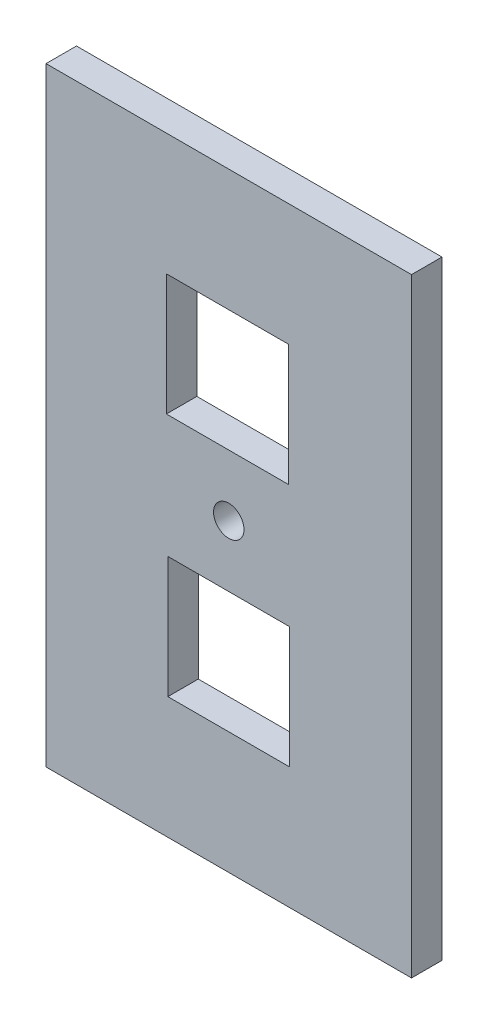
ISO-10303-21;
HEADER;
FILE_DESCRIPTION(('STEP AP214'),'2;1');
FILE_NAME('part.step','',(''),(''),'','','');
FILE_SCHEMA(('AUTOMOTIVE_DESIGN { 1 0 10303 214 1 1 1 1 }'));
ENDSEC;
DATA;
#1=APPLICATION_CONTEXT('core data for automotive mechanical design processes');
#2=APPLICATION_PROTOCOL_DEFINITION('international standard','automotive_design',2000,#1);
#3=PRODUCT_CONTEXT('',#1,'mechanical');
#4=PRODUCT('Part','Part','',(#3));
#5=PRODUCT_RELATED_PRODUCT_CATEGORY('part','',(#4));
#6=PRODUCT_DEFINITION_FORMATION('','',#4);
#7=PRODUCT_DEFINITION_CONTEXT('part definition',#1,'design');
#8=PRODUCT_DEFINITION('design','',#6,#7);
#9=PRODUCT_DEFINITION_SHAPE('','',#8);
#10=(LENGTH_UNIT() NAMED_UNIT(*) SI_UNIT(.MILLI.,.METRE.));
#11=(NAMED_UNIT(*) PLANE_ANGLE_UNIT() SI_UNIT($,.RADIAN.));
#12=(NAMED_UNIT(*) SI_UNIT($,.STERADIAN.) SOLID_ANGLE_UNIT());
#13=UNCERTAINTY_MEASURE_WITH_UNIT(LENGTH_MEASURE(1.E-05),#10,'distance_accuracy_value','');
#14=(GEOMETRIC_REPRESENTATION_CONTEXT(3) GLOBAL_UNCERTAINTY_ASSIGNED_CONTEXT((#13)) GLOBAL_UNIT_ASSIGNED_CONTEXT((#10,
#11,#12)) REPRESENTATION_CONTEXT('',''));
#15=CARTESIAN_POINT('',(0.,0.,0.));
#16=DIRECTION('',(0.,0.,1.));
#17=DIRECTION('',(1.,0.,0.));
#18=AXIS2_PLACEMENT_3D('',#15,#16,#17);
#19=CARTESIAN_POINT('',(0.,0.,6.35));
#20=DIRECTION('',(0.,1.,0.));
#21=DIRECTION('',(0.,0.,1.));
#22=AXIS2_PLACEMENT_3D('',#19,#20,#21);
#23=PLANE('',#22);
#24=DIRECTION('',(1.,0.,0.));
#25=VECTOR('',#24,1.);
#26=CARTESIAN_POINT('',(0.,0.,0.));
#27=LINE('',#26,#25);
#28=CARTESIAN_POINT('',(0.,0.,0.));
#29=VERTEX_POINT('',#28);
#30=CARTESIAN_POINT('',(76.2,0.,0.));
#31=VERTEX_POINT('',#30);
#32=EDGE_CURVE('E187',#29,#31,#27,.T.);
#33=ORIENTED_EDGE('',*,*,#32,.T.);
#34=DIRECTION('',(0.,0.,-1.));
#35=VECTOR('',#34,1.);
#36=CARTESIAN_POINT('',(76.2,0.,6.35));
#37=LINE('',#36,#35);
#38=CARTESIAN_POINT('',(76.2,0.,6.35));
#39=VERTEX_POINT('',#38);
#40=EDGE_CURVE('E11',#39,#31,#37,.T.);
#41=ORIENTED_EDGE('',*,*,#40,.F.);
#42=DIRECTION('',(1.,0.,0.));
#43=VECTOR('',#42,1.);
#44=CARTESIAN_POINT('',(0.,0.,6.35));
#45=LINE('',#44,#43);
#46=CARTESIAN_POINT('',(0.,0.,6.35));
#47=VERTEX_POINT('',#46);
#48=EDGE_CURVE('E194',#47,#39,#45,.T.);
#49=ORIENTED_EDGE('',*,*,#48,.F.);
#50=DIRECTION('',(0.,0.,-1.));
#51=VECTOR('',#50,1.);
#52=CARTESIAN_POINT('',(0.,0.,6.35));
#53=LINE('',#52,#51);
#54=EDGE_CURVE('E206',#47,#29,#53,.T.);
#55=ORIENTED_EDGE('',*,*,#54,.T.);
#56=EDGE_LOOP('',(#33,#41,#49,#55));
#57=FACE_BOUND('',#56,.T.);
#58=ADVANCED_FACE('F33',(#57),#23,.F.);
#59=CARTESIAN_POINT('',(76.2,0.,6.35));
#60=DIRECTION('',(-1.,0.,0.));
#61=DIRECTION('',(0.,-1.,0.));
#62=AXIS2_PLACEMENT_3D('',#59,#60,#61);
#63=PLANE('',#62);
#64=DIRECTION('',(0.,1.,0.));
#65=VECTOR('',#64,1.);
#66=CARTESIAN_POINT('',(76.2,0.,0.));
#67=LINE('',#66,#65);
#68=CARTESIAN_POINT('',(76.2,127.,0.));
#69=VERTEX_POINT('',#68);
#70=EDGE_CURVE('E209',#31,#69,#67,.T.);
#71=ORIENTED_EDGE('',*,*,#70,.T.);
#72=DIRECTION('',(0.,0.,-1.));
#73=VECTOR('',#72,1.);
#74=CARTESIAN_POINT('',(76.2,127.,6.35));
#75=LINE('',#74,#73);
#76=CARTESIAN_POINT('',(76.2,127.,6.35));
#77=VERTEX_POINT('',#76);
#78=EDGE_CURVE('E40',#77,#69,#75,.T.);
#79=ORIENTED_EDGE('',*,*,#78,.F.);
#80=DIRECTION('',(0.,1.,0.));
#81=VECTOR('',#80,1.);
#82=CARTESIAN_POINT('',(76.2,0.,6.35));
#83=LINE('',#82,#81);
#84=EDGE_CURVE('E197',#39,#77,#83,.T.);
#85=ORIENTED_EDGE('',*,*,#84,.F.);
#86=ORIENTED_EDGE('',*,*,#40,.T.);
#87=EDGE_LOOP('',(#71,#79,#85,#86));
#88=FACE_BOUND('',#87,.T.);
#89=ADVANCED_FACE('F225',(#88),#63,.F.);
#90=CARTESIAN_POINT('',(0.,127.,6.35));
#91=DIRECTION('',(0.,1.,0.));
#92=DIRECTION('',(0.,0.,1.));
#93=AXIS2_PLACEMENT_3D('',#90,#91,#92);
#94=PLANE('',#93);
#95=DIRECTION('',(1.,0.,0.));
#96=VECTOR('',#95,1.);
#97=CARTESIAN_POINT('',(0.,127.,0.));
#98=LINE('',#97,#96);
#99=CARTESIAN_POINT('',(0.,127.,0.));
#100=VERTEX_POINT('',#99);
#101=EDGE_CURVE('E212',#100,#69,#98,.T.);
#102=ORIENTED_EDGE('',*,*,#101,.F.);
#103=DIRECTION('',(0.,0.,-1.));
#104=VECTOR('',#103,1.);
#105=CARTESIAN_POINT('',(0.,127.,6.35));
#106=LINE('',#105,#104);
#107=CARTESIAN_POINT('',(0.,127.,6.35));
#108=VERTEX_POINT('',#107);
#109=EDGE_CURVE('E218',#108,#100,#106,.T.);
#110=ORIENTED_EDGE('',*,*,#109,.F.);
#111=DIRECTION('',(1.,0.,0.));
#112=VECTOR('',#111,1.);
#113=CARTESIAN_POINT('',(0.,127.,6.35));
#114=LINE('',#113,#112);
#115=EDGE_CURVE('E200',#108,#77,#114,.T.);
#116=ORIENTED_EDGE('',*,*,#115,.T.);
#117=ORIENTED_EDGE('',*,*,#78,.T.);
#118=EDGE_LOOP('',(#102,#110,#116,#117));
#119=FACE_BOUND('',#118,.T.);
#120=ADVANCED_FACE('F222',(#119),#94,.T.);
#121=CARTESIAN_POINT('',(0.,0.,6.35));
#122=DIRECTION('',(-1.,0.,0.));
#123=DIRECTION('',(0.,0.,1.));
#124=AXIS2_PLACEMENT_3D('',#121,#122,#123);
#125=PLANE('',#124);
#126=DIRECTION('',(0.,1.,0.));
#127=VECTOR('',#126,1.);
#128=CARTESIAN_POINT('',(0.,0.,0.));
#129=LINE('',#128,#127);
#130=EDGE_CURVE('E198',#29,#100,#129,.T.);
#131=ORIENTED_EDGE('',*,*,#130,.F.);
#132=ORIENTED_EDGE('',*,*,#54,.F.);
#133=DIRECTION('',(0.,1.,0.));
#134=VECTOR('',#133,1.);
#135=CARTESIAN_POINT('',(0.,0.,6.35));
#136=LINE('',#135,#134);
#137=EDGE_CURVE('E203',#47,#108,#136,.T.);
#138=ORIENTED_EDGE('',*,*,#137,.T.);
#139=ORIENTED_EDGE('',*,*,#109,.T.);
#140=EDGE_LOOP('',(#131,#132,#138,#139));
#141=FACE_BOUND('',#140,.T.);
#142=ADVANCED_FACE('F231',(#141),#125,.T.);
#143=CARTESIAN_POINT('',(0.,0.,6.35));
#144=DIRECTION('',(0.,0.,1.));
#145=DIRECTION('',(1.,0.,0.));
#146=AXIS2_PLACEMENT_3D('',#143,#144,#145);
#147=PLANE('',#146);
#148=CARTESIAN_POINT('',(38.1,63.5,6.35));
#149=DIRECTION('',(0.,0.,1.));
#150=DIRECTION('',(1.,0.,0.));
#151=AXIS2_PLACEMENT_3D('',#148,#149,#150);
#152=CIRCLE('',#151,3.175);
#153=CARTESIAN_POINT('',(41.275,63.5,6.35));
#154=VERTEX_POINT('',#153);
#155=EDGE_CURVE('E145',#154,#154,#152,.T.);
#156=ORIENTED_EDGE('',*,*,#155,.F.);
#157=EDGE_LOOP('',(#156));
#158=FACE_BOUND('',#157,.T.);
#159=DIRECTION('',(0.,1.,0.));
#160=VECTOR('',#159,1.);
#161=CARTESIAN_POINT('',(50.586826542628,101.6,6.35));
#162=LINE('',#161,#160);
#163=CARTESIAN_POINT('',(50.5868265426281,76.2794906218932,6.35));
#164=VERTEX_POINT('',#163);
#165=CARTESIAN_POINT('',(50.586826542628,101.6,6.35));
#166=VERTEX_POINT('',#165);
#167=EDGE_CURVE('E47',#164,#166,#162,.T.);
#168=ORIENTED_EDGE('',*,*,#167,.F.);
#169=DIRECTION('',(1.,0.,0.));
#170=VECTOR('',#169,1.);
#171=CARTESIAN_POINT('',(25.0928890180958,76.2794906218932,6.35));
#172=LINE('',#171,#170);
#173=CARTESIAN_POINT('',(25.0928890180958,76.2794906218932,6.35));
#174=VERTEX_POINT('',#173);
#175=EDGE_CURVE('E139',#174,#164,#172,.T.);
#176=ORIENTED_EDGE('',*,*,#175,.F.);
#177=DIRECTION('',(0.,-1.,0.));
#178=VECTOR('',#177,1.);
#179=CARTESIAN_POINT('',(25.0928890180958,101.6,6.35));
#180=LINE('',#179,#178);
#181=CARTESIAN_POINT('',(25.0928890180958,101.6,6.35));
#182=VERTEX_POINT('',#181);
#183=EDGE_CURVE('E142',#182,#174,#180,.T.);
#184=ORIENTED_EDGE('',*,*,#183,.F.);
#185=DIRECTION('',(-1.,0.,0.));
#186=VECTOR('',#185,1.);
#187=CARTESIAN_POINT('',(25.0928890180958,101.6,6.35));
#188=LINE('',#187,#186);
#189=EDGE_CURVE('E151',#166,#182,#188,.T.);
#190=ORIENTED_EDGE('',*,*,#189,.F.);
#191=EDGE_LOOP('',(#168,#176,#184,#190));
#192=FACE_BOUND('',#191,.T.);
#193=DIRECTION('',(0.,1.,0.));
#194=VECTOR('',#193,1.);
#195=CARTESIAN_POINT('',(50.8,50.7205093781068,6.35));
#196=LINE('',#195,#194);
#197=CARTESIAN_POINT('',(50.8,25.4,6.35));
#198=VERTEX_POINT('',#197);
#199=CARTESIAN_POINT('',(50.8,50.7205093781068,6.35));
#200=VERTEX_POINT('',#199);
#201=EDGE_CURVE('E158',#198,#200,#196,.T.);
#202=ORIENTED_EDGE('',*,*,#201,.F.);
#203=DIRECTION('',(1.,0.,0.));
#204=VECTOR('',#203,1.);
#205=CARTESIAN_POINT('',(25.4,25.4,6.35));
#206=LINE('',#205,#204);
#207=CARTESIAN_POINT('',(25.4,25.4,6.35));
#208=VERTEX_POINT('',#207);
#209=EDGE_CURVE('E166',#208,#198,#206,.T.);
#210=ORIENTED_EDGE('',*,*,#209,.F.);
#211=DIRECTION('',(0.,-1.,0.));
#212=VECTOR('',#211,1.);
#213=CARTESIAN_POINT('',(25.4,50.7205093781068,6.35));
#214=LINE('',#213,#212);
#215=CARTESIAN_POINT('',(25.4,50.7205093781068,6.35));
#216=VERTEX_POINT('',#215);
#217=EDGE_CURVE('E180',#216,#208,#214,.T.);
#218=ORIENTED_EDGE('',*,*,#217,.F.);
#219=DIRECTION('',(-1.,0.,0.));
#220=VECTOR('',#219,1.);
#221=CARTESIAN_POINT('',(25.4,50.7205093781068,6.35));
#222=LINE('',#221,#220);
#223=EDGE_CURVE('E177',#200,#216,#222,.T.);
#224=ORIENTED_EDGE('',*,*,#223,.F.);
#225=EDGE_LOOP('',(#202,#210,#218,#224));
#226=FACE_BOUND('',#225,.T.);
#227=ORIENTED_EDGE('',*,*,#48,.T.);
#228=ORIENTED_EDGE('',*,*,#84,.T.);
#229=ORIENTED_EDGE('',*,*,#115,.F.);
#230=ORIENTED_EDGE('',*,*,#137,.F.);
#231=EDGE_LOOP('',(#227,#228,#229,#230));
#232=FACE_BOUND('',#231,.T.);
#233=ADVANCED_FACE('F235',(#158,#192,#226,#232),#147,.T.);
#234=CARTESIAN_POINT('',(0.,0.,0.));
#235=DIRECTION('',(0.,0.,1.));
#236=DIRECTION('',(1.,0.,0.));
#237=AXIS2_PLACEMENT_3D('',#234,#235,#236);
#238=PLANE('',#237);
#239=CARTESIAN_POINT('',(38.1,63.5,0.));
#240=DIRECTION('',(0.,0.,1.));
#241=DIRECTION('',(1.,0.,0.));
#242=AXIS2_PLACEMENT_3D('',#239,#240,#241);
#243=CIRCLE('',#242,3.175);
#244=CARTESIAN_POINT('',(41.275,63.5,0.));
#245=VERTEX_POINT('',#244);
#246=EDGE_CURVE('E152',#245,#245,#243,.T.);
#247=ORIENTED_EDGE('',*,*,#246,.T.);
#248=EDGE_LOOP('',(#247));
#249=FACE_BOUND('',#248,.T.);
#250=DIRECTION('',(1.,0.,0.));
#251=VECTOR('',#250,1.);
#252=CARTESIAN_POINT('',(25.0928890180958,76.2794906218932,0.));
#253=LINE('',#252,#251);
#254=CARTESIAN_POINT('',(25.0928890180958,76.2794906218932,0.));
#255=VERTEX_POINT('',#254);
#256=CARTESIAN_POINT('',(50.5868265426281,76.2794906218932,0.));
#257=VERTEX_POINT('',#256);
#258=EDGE_CURVE('E129',#255,#257,#253,.T.);
#259=ORIENTED_EDGE('',*,*,#258,.T.);
#260=DIRECTION('',(0.,1.,0.));
#261=VECTOR('',#260,1.);
#262=CARTESIAN_POINT('',(50.586826542628,101.6,0.));
#263=LINE('',#262,#261);
#264=CARTESIAN_POINT('',(50.586826542628,101.6,0.));
#265=VERTEX_POINT('',#264);
#266=EDGE_CURVE('E123',#257,#265,#263,.T.);
#267=ORIENTED_EDGE('',*,*,#266,.T.);
#268=DIRECTION('',(-1.,0.,0.));
#269=VECTOR('',#268,1.);
#270=CARTESIAN_POINT('',(25.0928890180958,101.6,0.));
#271=LINE('',#270,#269);
#272=CARTESIAN_POINT('',(25.0928890180958,101.6,0.));
#273=VERTEX_POINT('',#272);
#274=EDGE_CURVE('E132',#265,#273,#271,.T.);
#275=ORIENTED_EDGE('',*,*,#274,.T.);
#276=DIRECTION('',(0.,-1.,0.));
#277=VECTOR('',#276,1.);
#278=CARTESIAN_POINT('',(25.0928890180958,101.6,0.));
#279=LINE('',#278,#277);
#280=EDGE_CURVE('E55',#273,#255,#279,.T.);
#281=ORIENTED_EDGE('',*,*,#280,.T.);
#282=EDGE_LOOP('',(#259,#267,#275,#281));
#283=FACE_BOUND('',#282,.T.);
#284=DIRECTION('',(1.,0.,0.));
#285=VECTOR('',#284,1.);
#286=CARTESIAN_POINT('',(25.4,25.4,0.));
#287=LINE('',#286,#285);
#288=CARTESIAN_POINT('',(25.4,25.4,0.));
#289=VERTEX_POINT('',#288);
#290=CARTESIAN_POINT('',(50.8,25.4,0.));
#291=VERTEX_POINT('',#290);
#292=EDGE_CURVE('E172',#289,#291,#287,.T.);
#293=ORIENTED_EDGE('',*,*,#292,.T.);
#294=DIRECTION('',(0.,1.,0.));
#295=VECTOR('',#294,1.);
#296=CARTESIAN_POINT('',(50.8,50.7205093781068,0.));
#297=LINE('',#296,#295);
#298=CARTESIAN_POINT('',(50.8,50.7205093781068,0.));
#299=VERTEX_POINT('',#298);
#300=EDGE_CURVE('E162',#291,#299,#297,.T.);
#301=ORIENTED_EDGE('',*,*,#300,.T.);
#302=DIRECTION('',(-1.,0.,0.));
#303=VECTOR('',#302,1.);
#304=CARTESIAN_POINT('',(25.4,50.7205093781068,0.));
#305=LINE('',#304,#303);
#306=CARTESIAN_POINT('',(25.4,50.7205093781068,0.));
#307=VERTEX_POINT('',#306);
#308=EDGE_CURVE('E165',#299,#307,#305,.T.);
#309=ORIENTED_EDGE('',*,*,#308,.T.);
#310=DIRECTION('',(0.,-1.,0.));
#311=VECTOR('',#310,1.);
#312=CARTESIAN_POINT('',(25.4,50.7205093781068,0.));
#313=LINE('',#312,#311);
#314=EDGE_CURVE('E169',#307,#289,#313,.T.);
#315=ORIENTED_EDGE('',*,*,#314,.T.);
#316=EDGE_LOOP('',(#293,#301,#309,#315));
#317=FACE_BOUND('',#316,.T.);
#318=ORIENTED_EDGE('',*,*,#32,.F.);
#319=ORIENTED_EDGE('',*,*,#130,.T.);
#320=ORIENTED_EDGE('',*,*,#101,.T.);
#321=ORIENTED_EDGE('',*,*,#70,.F.);
#322=EDGE_LOOP('',(#318,#319,#320,#321));
#323=FACE_BOUND('',#322,.T.);
#324=ADVANCED_FACE('F136',(#249,#283,#317,#323),#238,.F.);
#325=CARTESIAN_POINT('',(50.8,50.7205093781068,0.));
#326=DIRECTION('',(1.,0.,0.));
#327=DIRECTION('',(0.,1.,0.));
#328=AXIS2_PLACEMENT_3D('',#325,#326,#327);
#329=PLANE('',#328);
#330=ORIENTED_EDGE('',*,*,#201,.T.);
#331=DIRECTION('',(0.,0.,1.));
#332=VECTOR('',#331,1.);
#333=CARTESIAN_POINT('',(50.8,50.7205093781068,0.));
#334=LINE('',#333,#332);
#335=EDGE_CURVE('E175',#299,#200,#334,.T.);
#336=ORIENTED_EDGE('',*,*,#335,.F.);
#337=ORIENTED_EDGE('',*,*,#300,.F.);
#338=DIRECTION('',(0.,0.,1.));
#339=VECTOR('',#338,1.);
#340=CARTESIAN_POINT('',(50.8,25.4,0.));
#341=LINE('',#340,#339);
#342=EDGE_CURVE('E185',#291,#198,#341,.T.);
#343=ORIENTED_EDGE('',*,*,#342,.T.);
#344=EDGE_LOOP('',(#330,#336,#337,#343));
#345=FACE_BOUND('',#344,.T.);
#346=ADVANCED_FACE('F250',(#345),#329,.F.);
#347=CARTESIAN_POINT('',(25.4,25.4,0.));
#348=DIRECTION('',(0.,-1.,0.));
#349=DIRECTION('',(0.,0.,-1.));
#350=AXIS2_PLACEMENT_3D('',#347,#348,#349);
#351=PLANE('',#350);
#352=ORIENTED_EDGE('',*,*,#209,.T.);
#353=ORIENTED_EDGE('',*,*,#342,.F.);
#354=ORIENTED_EDGE('',*,*,#292,.F.);
#355=DIRECTION('',(0.,0.,1.));
#356=VECTOR('',#355,1.);
#357=CARTESIAN_POINT('',(25.4,25.4,0.));
#358=LINE('',#357,#356);
#359=EDGE_CURVE('E188',#289,#208,#358,.T.);
#360=ORIENTED_EDGE('',*,*,#359,.T.);
#361=EDGE_LOOP('',(#352,#353,#354,#360));
#362=FACE_BOUND('',#361,.T.);
#363=ADVANCED_FACE('F257',(#362),#351,.F.);
#364=CARTESIAN_POINT('',(25.4,50.7205093781068,0.));
#365=DIRECTION('',(-1.,0.,0.));
#366=DIRECTION('',(0.,-1.,0.));
#367=AXIS2_PLACEMENT_3D('',#364,#365,#366);
#368=PLANE('',#367);
#369=ORIENTED_EDGE('',*,*,#217,.T.);
#370=ORIENTED_EDGE('',*,*,#359,.F.);
#371=ORIENTED_EDGE('',*,*,#314,.F.);
#372=DIRECTION('',(0.,0.,1.));
#373=VECTOR('',#372,1.);
#374=CARTESIAN_POINT('',(25.4,50.7205093781068,0.));
#375=LINE('',#374,#373);
#376=EDGE_CURVE('E190',#307,#216,#375,.T.);
#377=ORIENTED_EDGE('',*,*,#376,.T.);
#378=EDGE_LOOP('',(#369,#370,#371,#377));
#379=FACE_BOUND('',#378,.T.);
#380=ADVANCED_FACE('F262',(#379),#368,.F.);
#381=CARTESIAN_POINT('',(25.4,50.7205093781068,0.));
#382=DIRECTION('',(0.,1.,0.));
#383=DIRECTION('',(0.,0.,1.));
#384=AXIS2_PLACEMENT_3D('',#381,#382,#383);
#385=PLANE('',#384);
#386=ORIENTED_EDGE('',*,*,#223,.T.);
#387=ORIENTED_EDGE('',*,*,#376,.F.);
#388=ORIENTED_EDGE('',*,*,#308,.F.);
#389=ORIENTED_EDGE('',*,*,#335,.T.);
#390=EDGE_LOOP('',(#386,#387,#388,#389));
#391=FACE_BOUND('',#390,.T.);
#392=ADVANCED_FACE('F259',(#391),#385,.F.);
#393=CARTESIAN_POINT('',(50.586826542628,101.6,0.));
#394=DIRECTION('',(1.,0.,0.));
#395=DIRECTION('',(0.,1.,0.));
#396=AXIS2_PLACEMENT_3D('',#393,#394,#395);
#397=PLANE('',#396);
#398=ORIENTED_EDGE('',*,*,#167,.T.);
#399=DIRECTION('',(0.,0.,1.));
#400=VECTOR('',#399,1.);
#401=CARTESIAN_POINT('',(50.586826542628,101.6,0.));
#402=LINE('',#401,#400);
#403=EDGE_CURVE('E119',#265,#166,#402,.T.);
#404=ORIENTED_EDGE('',*,*,#403,.F.);
#405=ORIENTED_EDGE('',*,*,#266,.F.);
#406=DIRECTION('',(0.,0.,1.));
#407=VECTOR('',#406,1.);
#408=CARTESIAN_POINT('',(50.5868265426281,76.2794906218932,0.));
#409=LINE('',#408,#407);
#410=EDGE_CURVE('E156',#257,#164,#409,.T.);
#411=ORIENTED_EDGE('',*,*,#410,.T.);
#412=EDGE_LOOP('',(#398,#404,#405,#411));
#413=FACE_BOUND('',#412,.T.);
#414=ADVANCED_FACE('F121',(#413),#397,.F.);
#415=CARTESIAN_POINT('',(25.0928890180958,76.2794906218932,0.));
#416=DIRECTION('',(0.,-1.,0.));
#417=DIRECTION('',(0.,0.,-1.));
#418=AXIS2_PLACEMENT_3D('',#415,#416,#417);
#419=PLANE('',#418);
#420=ORIENTED_EDGE('',*,*,#175,.T.);
#421=ORIENTED_EDGE('',*,*,#410,.F.);
#422=ORIENTED_EDGE('',*,*,#258,.F.);
#423=DIRECTION('',(0.,0.,1.));
#424=VECTOR('',#423,1.);
#425=CARTESIAN_POINT('',(25.0928890180958,76.2794906218932,0.));
#426=LINE('',#425,#424);
#427=EDGE_CURVE('E159',#255,#174,#426,.T.);
#428=ORIENTED_EDGE('',*,*,#427,.T.);
#429=EDGE_LOOP('',(#420,#421,#422,#428));
#430=FACE_BOUND('',#429,.T.);
#431=ADVANCED_FACE('F272',(#430),#419,.F.);
#432=CARTESIAN_POINT('',(25.0928890180958,101.6,0.));
#433=DIRECTION('',(-1.,0.,0.));
#434=DIRECTION('',(0.,-1.,0.));
#435=AXIS2_PLACEMENT_3D('',#432,#433,#434);
#436=PLANE('',#435);
#437=ORIENTED_EDGE('',*,*,#183,.T.);
#438=ORIENTED_EDGE('',*,*,#427,.F.);
#439=ORIENTED_EDGE('',*,*,#280,.F.);
#440=DIRECTION('',(0.,0.,1.));
#441=VECTOR('',#440,1.);
#442=CARTESIAN_POINT('',(25.0928890180958,101.6,0.));
#443=LINE('',#442,#441);
#444=EDGE_CURVE('E128',#273,#182,#443,.T.);
#445=ORIENTED_EDGE('',*,*,#444,.T.);
#446=EDGE_LOOP('',(#437,#438,#439,#445));
#447=FACE_BOUND('',#446,.T.);
#448=ADVANCED_FACE('F276',(#447),#436,.F.);
#449=CARTESIAN_POINT('',(25.0928890180958,101.6,0.));
#450=DIRECTION('',(0.,1.,0.));
#451=DIRECTION('',(0.,0.,1.));
#452=AXIS2_PLACEMENT_3D('',#449,#450,#451);
#453=PLANE('',#452);
#454=ORIENTED_EDGE('',*,*,#189,.T.);
#455=ORIENTED_EDGE('',*,*,#444,.F.);
#456=ORIENTED_EDGE('',*,*,#274,.F.);
#457=ORIENTED_EDGE('',*,*,#403,.T.);
#458=EDGE_LOOP('',(#454,#455,#456,#457));
#459=FACE_BOUND('',#458,.T.);
#460=ADVANCED_FACE('F133',(#459),#453,.F.);
#461=CARTESIAN_POINT('',(38.1,63.5,0.));
#462=DIRECTION('',(0.,0.,1.));
#463=DIRECTION('',(1.,0.,0.));
#464=AXIS2_PLACEMENT_3D('',#461,#462,#463);
#465=CYLINDRICAL_SURFACE('',#464,3.175);
#466=ORIENTED_EDGE('',*,*,#246,.F.);
#467=EDGE_LOOP('',(#466));
#468=FACE_BOUND('',#467,.T.);
#469=ORIENTED_EDGE('',*,*,#155,.T.);
#470=EDGE_LOOP('',(#469));
#471=FACE_BOUND('',#470,.T.);
#472=ADVANCED_FACE('F275',(#468,#471),#465,.F.);
#473=CLOSED_SHELL('',(#58,#89,#120,#142,#233,#324,#346,#363,#380,#392,#414,#431,#448,#460,#472));
#474=MANIFOLD_SOLID_BREP('B2',#473);
#475=ADVANCED_BREP_SHAPE_REPRESENTATION('',(#18,#474),#14);
#476=SHAPE_DEFINITION_REPRESENTATION(#9,#475);
ENDSEC;
END-ISO-10303-21;
